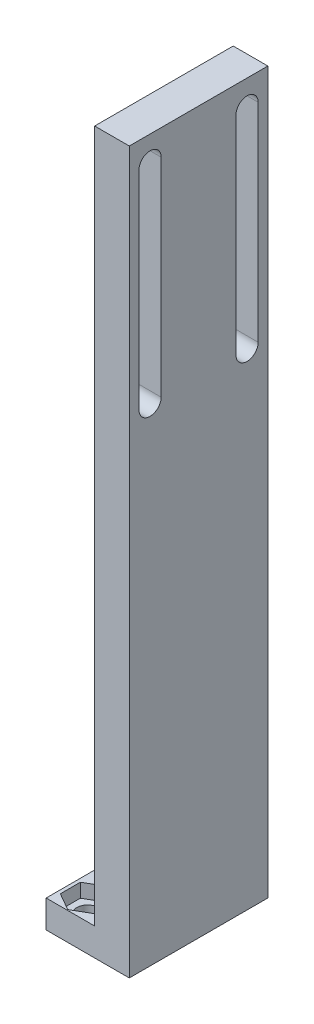
ISO-10303-21;
HEADER;
FILE_DESCRIPTION(('STEP AP214'),'2;1');
FILE_NAME('part.step','',(''),(''),'','','');
FILE_SCHEMA(('AUTOMOTIVE_DESIGN { 1 0 10303 214 1 1 1 1 }'));
ENDSEC;
DATA;
#1=APPLICATION_CONTEXT('core data for automotive mechanical design processes');
#2=APPLICATION_PROTOCOL_DEFINITION('international standard','automotive_design',2000,#1);
#3=PRODUCT_CONTEXT('',#1,'mechanical');
#4=PRODUCT('Part','Part','',(#3));
#5=PRODUCT_RELATED_PRODUCT_CATEGORY('part','',(#4));
#6=PRODUCT_DEFINITION_FORMATION('','',#4);
#7=PRODUCT_DEFINITION_CONTEXT('part definition',#1,'design');
#8=PRODUCT_DEFINITION('design','',#6,#7);
#9=PRODUCT_DEFINITION_SHAPE('','',#8);
#10=(LENGTH_UNIT() NAMED_UNIT(*) SI_UNIT(.MILLI.,.METRE.));
#11=(NAMED_UNIT(*) PLANE_ANGLE_UNIT() SI_UNIT($,.RADIAN.));
#12=(NAMED_UNIT(*) SI_UNIT($,.STERADIAN.) SOLID_ANGLE_UNIT());
#13=UNCERTAINTY_MEASURE_WITH_UNIT(LENGTH_MEASURE(1.E-05),#10,'distance_accuracy_value','');
#14=(GEOMETRIC_REPRESENTATION_CONTEXT(3) GLOBAL_UNCERTAINTY_ASSIGNED_CONTEXT((#13)) GLOBAL_UNIT_ASSIGNED_CONTEXT((#10,
#11,#12)) REPRESENTATION_CONTEXT('',''));
#15=CARTESIAN_POINT('',(0.,0.,0.));
#16=DIRECTION('',(0.,0.,1.));
#17=DIRECTION('',(1.,0.,0.));
#18=AXIS2_PLACEMENT_3D('',#15,#16,#17);
#19=CARTESIAN_POINT('',(-3.,4.,-7.));
#20=DIRECTION('',(0.,-1.,0.));
#21=DIRECTION('',(0.,0.,-1.));
#22=AXIS2_PLACEMENT_3D('',#19,#20,#21);
#23=CYLINDRICAL_SURFACE('',#22,1.6);
#24=CARTESIAN_POINT('',(-3.,0.,-7.));
#25=DIRECTION('',(0.,1.,0.));
#26=DIRECTION('',(0.,0.,1.));
#27=AXIS2_PLACEMENT_3D('',#24,#25,#26);
#28=CIRCLE('',#27,1.6);
#29=CARTESIAN_POINT('',(-3.,0.,-5.4));
#30=VERTEX_POINT('',#29);
#31=EDGE_CURVE('E397',#30,#30,#28,.T.);
#32=ORIENTED_EDGE('',*,*,#31,.F.);
#33=EDGE_LOOP('',(#32));
#34=FACE_BOUND('',#33,.T.);
#35=CARTESIAN_POINT('',(-3.,2.,-7.));
#36=DIRECTION('',(0.,1.,0.));
#37=DIRECTION('',(0.,0.,1.));
#38=AXIS2_PLACEMENT_3D('',#35,#36,#37);
#39=CIRCLE('',#38,1.6);
#40=CARTESIAN_POINT('',(-3.,2.,-5.4));
#41=VERTEX_POINT('',#40);
#42=EDGE_CURVE('E37',#41,#41,#39,.T.);
#43=ORIENTED_EDGE('',*,*,#42,.T.);
#44=EDGE_LOOP('',(#43));
#45=FACE_BOUND('',#44,.T.);
#46=ADVANCED_FACE('F33',(#34,#45),#23,.F.);
#47=CARTESIAN_POINT('',(-3.,4.,7.));
#48=DIRECTION('',(0.,-1.,0.));
#49=DIRECTION('',(0.,0.,-1.));
#50=AXIS2_PLACEMENT_3D('',#47,#48,#49);
#51=CYLINDRICAL_SURFACE('',#50,1.6);
#52=CARTESIAN_POINT('',(-3.,0.,7.));
#53=DIRECTION('',(0.,1.,0.));
#54=DIRECTION('',(0.,0.,1.));
#55=AXIS2_PLACEMENT_3D('',#52,#53,#54);
#56=CIRCLE('',#55,1.6);
#57=CARTESIAN_POINT('',(-3.,0.,8.6));
#58=VERTEX_POINT('',#57);
#59=EDGE_CURVE('E394',#58,#58,#56,.T.);
#60=ORIENTED_EDGE('',*,*,#59,.F.);
#61=EDGE_LOOP('',(#60));
#62=FACE_BOUND('',#61,.T.);
#63=CARTESIAN_POINT('',(-3.,2.,7.));
#64=DIRECTION('',(0.,1.,0.));
#65=DIRECTION('',(0.,0.,1.));
#66=AXIS2_PLACEMENT_3D('',#63,#64,#65);
#67=CIRCLE('',#66,1.6);
#68=CARTESIAN_POINT('',(-3.,2.,8.6));
#69=VERTEX_POINT('',#68);
#70=EDGE_CURVE('E317',#69,#69,#67,.T.);
#71=ORIENTED_EDGE('',*,*,#70,.T.);
#72=EDGE_LOOP('',(#71));
#73=FACE_BOUND('',#72,.T.);
#74=ADVANCED_FACE('F463',(#62,#73),#51,.F.);
#75=CARTESIAN_POINT('',(0.,4.,0.));
#76=DIRECTION('',(0.,1.,0.));
#77=DIRECTION('',(0.,0.,1.));
#78=AXIS2_PLACEMENT_3D('',#75,#76,#77);
#79=PLANE('',#78);
#80=DIRECTION('',(0.870400011805041,0.,-0.492345223851907));
#81=VECTOR('',#80,1.);
#82=CARTESIAN_POINT('',(-3.02563994997294,4.,-4.09194660254121));
#83=LINE('',#82,#81);
#84=CARTESIAN_POINT('',(-3.02563994997294,4.,-4.09194660254121));
#85=VERTEX_POINT('',#84);
#86=CARTESIAN_POINT('',(-0.494371857225514,4.,-5.52376845324228));
#87=VERTEX_POINT('',#86);
#88=EDGE_CURVE('E298',#85,#87,#83,.T.);
#89=ORIENTED_EDGE('',*,*,#88,.F.);
#90=DIRECTION('',(0.861583477190208,0.,0.507615909751487));
#91=VECTOR('',#90,1.);
#92=CARTESIAN_POINT('',(-5.53126809274743,4.,-5.56817814929894));
#93=LINE('',#92,#91);
#94=CARTESIAN_POINT('',(-5.53126809274743,4.,-5.56817814929894));
#95=VERTEX_POINT('',#94);
#96=EDGE_CURVE('E282',#95,#85,#93,.T.);
#97=ORIENTED_EDGE('',*,*,#96,.F.);
#98=DIRECTION('',(-0.00881653461483258,0.,0.999961133603394));
#99=VECTOR('',#98,1.);
#100=CARTESIAN_POINT('',(-5.50562814277449,4.,-8.47623154675772));
#101=LINE('',#100,#99);
#102=CARTESIAN_POINT('',(-5.50562814277449,4.,-8.47623154675772));
#103=VERTEX_POINT('',#102);
#104=EDGE_CURVE('E310',#103,#95,#101,.T.);
#105=ORIENTED_EDGE('',*,*,#104,.F.);
#106=DIRECTION('',(-0.870400011805041,0.,0.492345223851907));
#107=VECTOR('',#106,1.);
#108=CARTESIAN_POINT('',(-2.97436005002706,4.,-9.90805339745879));
#109=LINE('',#108,#107);
#110=CARTESIAN_POINT('',(-2.97436005002706,4.,-9.90805339745879));
#111=VERTEX_POINT('',#110);
#112=EDGE_CURVE('E307',#111,#103,#109,.T.);
#113=ORIENTED_EDGE('',*,*,#112,.F.);
#114=DIRECTION('',(-0.861583477190208,0.,-0.507615909751488));
#115=VECTOR('',#114,1.);
#116=CARTESIAN_POINT('',(-0.468731907252576,4.,-8.43182185070106));
#117=LINE('',#116,#115);
#118=CARTESIAN_POINT('',(-0.468731907252576,4.,-8.43182185070106));
#119=VERTEX_POINT('',#118);
#120=EDGE_CURVE('E304',#119,#111,#117,.T.);
#121=ORIENTED_EDGE('',*,*,#120,.F.);
#122=DIRECTION('',(0.00881653461483156,0.,-0.999961133603394));
#123=VECTOR('',#122,1.);
#124=CARTESIAN_POINT('',(-0.494371857225514,4.,-5.52376845324228));
#125=LINE('',#124,#123);
#126=EDGE_CURVE('E300',#87,#119,#125,.T.);
#127=ORIENTED_EDGE('',*,*,#126,.F.);
#128=EDGE_LOOP('',(#89,#97,#105,#113,#121,#127));
#129=FACE_BOUND('',#128,.T.);
#130=DIRECTION('',(0.865251743184693,0.,-0.5013376316574));
#131=VECTOR('',#130,1.);
#132=CARTESIAN_POINT('',(-2.9955331754008,4.,9.89067124305514));
#133=LINE('',#132,#131);
#134=CARTESIAN_POINT('',(-2.9955331754008,4.,9.89067124305514));
#135=VERTEX_POINT('',#134);
#136=CARTESIAN_POINT('',(-0.494371857225505,4.,8.44146723795042));
#137=VERTEX_POINT('',#136);
#138=EDGE_CURVE('E245',#135,#137,#133,.T.);
#139=ORIENTED_EDGE('',*,*,#138,.F.);
#140=DIRECTION('',(0.86679699648078,0.,0.498661174438013));
#141=VECTOR('',#140,1.);
#142=CARTESIAN_POINT('',(-5.5011613181753,4.,8.44920400510473));
#143=LINE('',#142,#141);
#144=CARTESIAN_POINT('',(-5.5011613181753,4.,8.44920400510473));
#145=VERTEX_POINT('',#144);
#146=EDGE_CURVE('E332',#145,#135,#143,.T.);
#147=ORIENTED_EDGE('',*,*,#146,.F.);
#148=DIRECTION('',(0.00154525329608749,0.,0.999998806095413));
#149=VECTOR('',#148,1.);
#150=CARTESIAN_POINT('',(-5.50562814277449,4.,5.55853276204958));
#151=LINE('',#150,#149);
#152=CARTESIAN_POINT('',(-5.50562814277449,4.,5.55853276204958));
#153=VERTEX_POINT('',#152);
#154=EDGE_CURVE('E358',#153,#145,#151,.T.);
#155=ORIENTED_EDGE('',*,*,#154,.F.);
#156=DIRECTION('',(-0.865251743184693,0.,0.5013376316574));
#157=VECTOR('',#156,1.);
#158=CARTESIAN_POINT('',(-3.0044668245992,4.,4.10932875694486));
#159=LINE('',#158,#157);
#160=CARTESIAN_POINT('',(-3.0044668245992,4.,4.10932875694486));
#161=VERTEX_POINT('',#160);
#162=EDGE_CURVE('E355',#161,#153,#159,.T.);
#163=ORIENTED_EDGE('',*,*,#162,.F.);
#164=DIRECTION('',(-0.86679699648078,0.,-0.498661174438013));
#165=VECTOR('',#164,1.);
#166=CARTESIAN_POINT('',(-0.498838681824703,4.,5.55079599489527));
#167=LINE('',#166,#165);
#168=CARTESIAN_POINT('',(-0.498838681824703,4.,5.55079599489527));
#169=VERTEX_POINT('',#168);
#170=EDGE_CURVE('E352',#169,#161,#167,.T.);
#171=ORIENTED_EDGE('',*,*,#170,.F.);
#172=DIRECTION('',(-0.001545253296087,0.,-0.999998806095413));
#173=VECTOR('',#172,1.);
#174=CARTESIAN_POINT('',(-0.494371857225505,4.,8.44146723795042));
#175=LINE('',#174,#173);
#176=EDGE_CURVE('E349',#137,#169,#175,.T.);
#177=ORIENTED_EDGE('',*,*,#176,.F.);
#178=EDGE_LOOP('',(#139,#147,#155,#163,#171,#177));
#179=FACE_BOUND('',#178,.T.);
#180=DIRECTION('',(0.,0.,1.));
#181=VECTOR('',#180,1.);
#182=CARTESIAN_POINT('',(0.999999999999999,4.,-10.));
#183=LINE('',#182,#181);
#184=CARTESIAN_POINT('',(1.,4.,-10.));
#185=VERTEX_POINT('',#184);
#186=CARTESIAN_POINT('',(1.,4.,10.));
#187=VERTEX_POINT('',#186);
#188=EDGE_CURVE('E378',#185,#187,#183,.T.);
#189=ORIENTED_EDGE('',*,*,#188,.F.);
#190=DIRECTION('',(-1.,0.,0.));
#191=VECTOR('',#190,1.);
#192=CARTESIAN_POINT('',(-6.,4.,-10.));
#193=LINE('',#192,#191);
#194=CARTESIAN_POINT('',(-6.,4.,-10.));
#195=VERTEX_POINT('',#194);
#196=EDGE_CURVE('E401',#185,#195,#193,.T.);
#197=ORIENTED_EDGE('',*,*,#196,.T.);
#198=DIRECTION('',(0.,0.,1.));
#199=VECTOR('',#198,1.);
#200=CARTESIAN_POINT('',(-6.,4.,-10.));
#201=LINE('',#200,#199);
#202=CARTESIAN_POINT('',(-6.,4.,10.));
#203=VERTEX_POINT('',#202);
#204=EDGE_CURVE('E403',#195,#203,#201,.T.);
#205=ORIENTED_EDGE('',*,*,#204,.T.);
#206=DIRECTION('',(1.,0.,0.));
#207=VECTOR('',#206,1.);
#208=CARTESIAN_POINT('',(-6.,4.,10.));
#209=LINE('',#208,#207);
#210=EDGE_CURVE('E406',#203,#187,#209,.T.);
#211=ORIENTED_EDGE('',*,*,#210,.T.);
#212=EDGE_LOOP('',(#189,#197,#205,#211));
#213=FACE_BOUND('',#212,.T.);
#214=ADVANCED_FACE('F459',(#129,#179,#213),#79,.T.);
#215=CARTESIAN_POINT('',(0.,0.,0.));
#216=DIRECTION('',(0.,1.,0.));
#217=DIRECTION('',(0.,0.,1.));
#218=AXIS2_PLACEMENT_3D('',#215,#216,#217);
#219=PLANE('',#218);
#220=DIRECTION('',(0.,0.,-1.));
#221=VECTOR('',#220,1.);
#222=CARTESIAN_POINT('',(6.,0.,-10.));
#223=LINE('',#222,#221);
#224=CARTESIAN_POINT('',(6.,0.,10.));
#225=VERTEX_POINT('',#224);
#226=CARTESIAN_POINT('',(6.,0.,-10.));
#227=VERTEX_POINT('',#226);
#228=EDGE_CURVE('E400',#225,#227,#223,.T.);
#229=ORIENTED_EDGE('',*,*,#228,.F.);
#230=DIRECTION('',(1.,0.,0.));
#231=VECTOR('',#230,1.);
#232=CARTESIAN_POINT('',(-6.,0.,10.));
#233=LINE('',#232,#231);
#234=CARTESIAN_POINT('',(-6.,0.,10.));
#235=VERTEX_POINT('',#234);
#236=EDGE_CURVE('E404',#235,#225,#233,.T.);
#237=ORIENTED_EDGE('',*,*,#236,.F.);
#238=DIRECTION('',(0.,0.,1.));
#239=VECTOR('',#238,1.);
#240=CARTESIAN_POINT('',(-6.,0.,-10.));
#241=LINE('',#240,#239);
#242=CARTESIAN_POINT('',(-6.,0.,-10.));
#243=VERTEX_POINT('',#242);
#244=EDGE_CURVE('E413',#243,#235,#241,.T.);
#245=ORIENTED_EDGE('',*,*,#244,.F.);
#246=DIRECTION('',(-1.,0.,0.));
#247=VECTOR('',#246,1.);
#248=CARTESIAN_POINT('',(-6.,0.,-10.));
#249=LINE('',#248,#247);
#250=EDGE_CURVE('E411',#227,#243,#249,.T.);
#251=ORIENTED_EDGE('',*,*,#250,.F.);
#252=EDGE_LOOP('',(#229,#237,#245,#251));
#253=FACE_BOUND('',#252,.T.);
#254=ORIENTED_EDGE('',*,*,#31,.T.);
#255=EDGE_LOOP('',(#254));
#256=FACE_BOUND('',#255,.T.);
#257=ORIENTED_EDGE('',*,*,#59,.T.);
#258=EDGE_LOOP('',(#257));
#259=FACE_BOUND('',#258,.T.);
#260=ADVANCED_FACE('F462',(#253,#256,#259),#219,.F.);
#261=CARTESIAN_POINT('',(6.,4.,-10.));
#262=DIRECTION('',(-1.,0.,0.));
#263=DIRECTION('',(0.,0.,1.));
#264=AXIS2_PLACEMENT_3D('',#261,#262,#263);
#265=PLANE('',#264);
#266=DIRECTION('',(0.,-1.,0.));
#267=VECTOR('',#266,1.);
#268=CARTESIAN_POINT('',(6.,100.304925489103,8.6));
#269=LINE('',#268,#267);
#270=CARTESIAN_POINT('',(6.,100.304925489103,8.6));
#271=VERTEX_POINT('',#270);
#272=CARTESIAN_POINT('',(6.,70.3049254891028,8.59999999999999));
#273=VERTEX_POINT('',#272);
#274=EDGE_CURVE('E238',#271,#273,#269,.T.);
#275=ORIENTED_EDGE('',*,*,#274,.F.);
#276=CARTESIAN_POINT('',(6.,100.304925489103,7.00000000000001));
#277=DIRECTION('',(1.,0.,0.));
#278=DIRECTION('',(0.,0.,-1.));
#279=AXIS2_PLACEMENT_3D('',#276,#277,#278);
#280=CIRCLE('',#279,1.6);
#281=CARTESIAN_POINT('',(6.,100.304925489103,5.40000000000001));
#282=VERTEX_POINT('',#281);
#283=EDGE_CURVE('E50',#282,#271,#280,.T.);
#284=ORIENTED_EDGE('',*,*,#283,.F.);
#285=DIRECTION('',(0.,1.,0.));
#286=VECTOR('',#285,1.);
#287=CARTESIAN_POINT('',(6.,100.304925489103,5.40000000000001));
#288=LINE('',#287,#286);
#289=CARTESIAN_POINT('',(6.,70.3049254891028,5.4));
#290=VERTEX_POINT('',#289);
#291=EDGE_CURVE('E229',#290,#282,#288,.T.);
#292=ORIENTED_EDGE('',*,*,#291,.F.);
#293=CARTESIAN_POINT('',(6.,70.3049254891028,7.));
#294=DIRECTION('',(1.,0.,0.));
#295=DIRECTION('',(0.,0.,-1.));
#296=AXIS2_PLACEMENT_3D('',#293,#294,#295);
#297=CIRCLE('',#296,1.6);
#298=EDGE_CURVE('E232',#273,#290,#297,.T.);
#299=ORIENTED_EDGE('',*,*,#298,.F.);
#300=EDGE_LOOP('',(#275,#284,#292,#299));
#301=FACE_BOUND('',#300,.T.);
#302=DIRECTION('',(0.,-1.,0.));
#303=VECTOR('',#302,1.);
#304=CARTESIAN_POINT('',(6.,100.170306459103,-5.4));
#305=LINE('',#304,#303);
#306=CARTESIAN_POINT('',(6.,100.170306459103,-5.4));
#307=VERTEX_POINT('',#306);
#308=CARTESIAN_POINT('',(6.,70.1703064591032,-5.40000000000001));
#309=VERTEX_POINT('',#308);
#310=EDGE_CURVE('E264',#307,#309,#305,.T.);
#311=ORIENTED_EDGE('',*,*,#310,.F.);
#312=CARTESIAN_POINT('',(6.,100.170306459103,-7.));
#313=DIRECTION('',(1.,0.,0.));
#314=DIRECTION('',(0.,0.,-1.));
#315=AXIS2_PLACEMENT_3D('',#312,#313,#314);
#316=CIRCLE('',#315,1.6);
#317=CARTESIAN_POINT('',(6.,100.170306459103,-8.6));
#318=VERTEX_POINT('',#317);
#319=EDGE_CURVE('E58',#318,#307,#316,.T.);
#320=ORIENTED_EDGE('',*,*,#319,.F.);
#321=DIRECTION('',(0.,1.,0.));
#322=VECTOR('',#321,1.);
#323=CARTESIAN_POINT('',(6.,100.170306459103,-8.6));
#324=LINE('',#323,#322);
#325=CARTESIAN_POINT('',(6.,70.1703064591032,-8.6));
#326=VERTEX_POINT('',#325);
#327=EDGE_CURVE('E253',#326,#318,#324,.T.);
#328=ORIENTED_EDGE('',*,*,#327,.F.);
#329=CARTESIAN_POINT('',(6.,70.1703064591032,-7.00000000000001));
#330=DIRECTION('',(1.,0.,0.));
#331=DIRECTION('',(0.,0.,-1.));
#332=AXIS2_PLACEMENT_3D('',#329,#330,#331);
#333=CIRCLE('',#332,1.6);
#334=EDGE_CURVE('E267',#309,#326,#333,.T.);
#335=ORIENTED_EDGE('',*,*,#334,.F.);
#336=EDGE_LOOP('',(#311,#320,#328,#335));
#337=FACE_BOUND('',#336,.T.);
#338=ORIENTED_EDGE('',*,*,#228,.T.);
#339=DIRECTION('',(0.,-1.,0.));
#340=VECTOR('',#339,1.);
#341=CARTESIAN_POINT('',(6.,4.,-10.));
#342=LINE('',#341,#340);
#343=CARTESIAN_POINT('',(6.,104.,-10.));
#344=VERTEX_POINT('',#343);
#345=EDGE_CURVE('E11',#344,#227,#342,.T.);
#346=ORIENTED_EDGE('',*,*,#345,.F.);
#347=DIRECTION('',(0.,0.,-1.));
#348=VECTOR('',#347,1.);
#349=CARTESIAN_POINT('',(6.,104.,-10.));
#350=LINE('',#349,#348);
#351=CARTESIAN_POINT('',(6.,104.,10.));
#352=VERTEX_POINT('',#351);
#353=EDGE_CURVE('E381',#352,#344,#350,.T.);
#354=ORIENTED_EDGE('',*,*,#353,.F.);
#355=DIRECTION('',(0.,-1.,0.));
#356=VECTOR('',#355,1.);
#357=CARTESIAN_POINT('',(6.,4.,10.));
#358=LINE('',#357,#356);
#359=EDGE_CURVE('E408',#352,#225,#358,.T.);
#360=ORIENTED_EDGE('',*,*,#359,.T.);
#361=EDGE_LOOP('',(#338,#346,#354,#360));
#362=FACE_BOUND('',#361,.T.);
#363=ADVANCED_FACE('F35',(#301,#337,#362),#265,.F.);
#364=CARTESIAN_POINT('',(-6.,4.,-10.));
#365=DIRECTION('',(0.,0.,1.));
#366=DIRECTION('',(1.,0.,0.));
#367=AXIS2_PLACEMENT_3D('',#364,#365,#366);
#368=PLANE('',#367);
#369=ORIENTED_EDGE('',*,*,#250,.T.);
#370=DIRECTION('',(0.,-1.,0.));
#371=VECTOR('',#370,1.);
#372=CARTESIAN_POINT('',(-6.,4.,-10.));
#373=LINE('',#372,#371);
#374=EDGE_CURVE('E42',#195,#243,#373,.T.);
#375=ORIENTED_EDGE('',*,*,#374,.F.);
#376=ORIENTED_EDGE('',*,*,#196,.F.);
#377=DIRECTION('',(0.,-1.,0.));
#378=VECTOR('',#377,1.);
#379=CARTESIAN_POINT('',(0.999999999999999,104.,-10.));
#380=LINE('',#379,#378);
#381=CARTESIAN_POINT('',(0.999999999999999,104.,-10.));
#382=VERTEX_POINT('',#381);
#383=EDGE_CURVE('E386',#382,#185,#380,.T.);
#384=ORIENTED_EDGE('',*,*,#383,.F.);
#385=DIRECTION('',(-1.,0.,0.));
#386=VECTOR('',#385,1.);
#387=CARTESIAN_POINT('',(0.999999999999999,104.,-10.));
#388=LINE('',#387,#386);
#389=EDGE_CURVE('E384',#344,#382,#388,.T.);
#390=ORIENTED_EDGE('',*,*,#389,.F.);
#391=ORIENTED_EDGE('',*,*,#345,.T.);
#392=EDGE_LOOP('',(#369,#375,#376,#384,#390,#391));
#393=FACE_BOUND('',#392,.T.);
#394=ADVANCED_FACE('F476',(#393),#368,.F.);
#395=CARTESIAN_POINT('',(-6.,4.,-10.));
#396=DIRECTION('',(1.,0.,0.));
#397=DIRECTION('',(0.,0.,-1.));
#398=AXIS2_PLACEMENT_3D('',#395,#396,#397);
#399=PLANE('',#398);
#400=ORIENTED_EDGE('',*,*,#244,.T.);
#401=DIRECTION('',(0.,-1.,0.));
#402=VECTOR('',#401,1.);
#403=CARTESIAN_POINT('',(-6.,4.,10.));
#404=LINE('',#403,#402);
#405=EDGE_CURVE('E418',#203,#235,#404,.T.);
#406=ORIENTED_EDGE('',*,*,#405,.F.);
#407=ORIENTED_EDGE('',*,*,#204,.F.);
#408=ORIENTED_EDGE('',*,*,#374,.T.);
#409=EDGE_LOOP('',(#400,#406,#407,#408));
#410=FACE_BOUND('',#409,.T.);
#411=ADVANCED_FACE('F491',(#410),#399,.F.);
#412=CARTESIAN_POINT('',(-6.,4.,10.));
#413=DIRECTION('',(0.,0.,-1.));
#414=DIRECTION('',(-1.,0.,0.));
#415=AXIS2_PLACEMENT_3D('',#412,#413,#414);
#416=PLANE('',#415);
#417=ORIENTED_EDGE('',*,*,#236,.T.);
#418=ORIENTED_EDGE('',*,*,#359,.F.);
#419=DIRECTION('',(1.,0.,0.));
#420=VECTOR('',#419,1.);
#421=CARTESIAN_POINT('',(1.,104.,10.));
#422=LINE('',#421,#420);
#423=CARTESIAN_POINT('',(1.,104.,10.));
#424=VERTEX_POINT('',#423);
#425=EDGE_CURVE('E377',#424,#352,#422,.T.);
#426=ORIENTED_EDGE('',*,*,#425,.F.);
#427=DIRECTION('',(0.,-1.,0.));
#428=VECTOR('',#427,1.);
#429=CARTESIAN_POINT('',(1.,104.,10.));
#430=LINE('',#429,#428);
#431=EDGE_CURVE('E391',#424,#187,#430,.T.);
#432=ORIENTED_EDGE('',*,*,#431,.T.);
#433=ORIENTED_EDGE('',*,*,#210,.F.);
#434=ORIENTED_EDGE('',*,*,#405,.T.);
#435=EDGE_LOOP('',(#417,#418,#426,#432,#433,#434));
#436=FACE_BOUND('',#435,.T.);
#437=ADVANCED_FACE('F493',(#436),#416,.F.);
#438=CARTESIAN_POINT('',(0.999999999999999,104.,-10.));
#439=DIRECTION('',(1.,0.,0.));
#440=DIRECTION('',(0.,0.,-1.));
#441=AXIS2_PLACEMENT_3D('',#438,#439,#440);
#442=PLANE('',#441);
#443=DIRECTION('',(0.,1.,0.));
#444=VECTOR('',#443,1.);
#445=CARTESIAN_POINT('',(1.,100.304925489103,5.40000000000001));
#446=LINE('',#445,#444);
#447=CARTESIAN_POINT('',(1.,70.3049254891028,5.4));
#448=VERTEX_POINT('',#447);
#449=CARTESIAN_POINT('',(1.,100.304925489103,5.40000000000001));
#450=VERTEX_POINT('',#449);
#451=EDGE_CURVE('E216',#448,#450,#446,.T.);
#452=ORIENTED_EDGE('',*,*,#451,.T.);
#453=CARTESIAN_POINT('',(1.,100.304925489103,7.00000000000001));
#454=DIRECTION('',(1.,0.,0.));
#455=DIRECTION('',(0.,0.,-1.));
#456=AXIS2_PLACEMENT_3D('',#453,#454,#455);
#457=CIRCLE('',#456,1.6);
#458=CARTESIAN_POINT('',(1.,100.304925489103,8.6));
#459=VERTEX_POINT('',#458);
#460=EDGE_CURVE('E210',#450,#459,#457,.T.);
#461=ORIENTED_EDGE('',*,*,#460,.T.);
#462=DIRECTION('',(0.,-1.,0.));
#463=VECTOR('',#462,1.);
#464=CARTESIAN_POINT('',(1.,100.304925489103,8.6));
#465=LINE('',#464,#463);
#466=CARTESIAN_POINT('',(1.,70.3049254891028,8.59999999999999));
#467=VERTEX_POINT('',#466);
#468=EDGE_CURVE('E220',#459,#467,#465,.T.);
#469=ORIENTED_EDGE('',*,*,#468,.T.);
#470=CARTESIAN_POINT('',(1.,70.3049254891028,7.));
#471=DIRECTION('',(1.,0.,0.));
#472=DIRECTION('',(0.,0.,-1.));
#473=AXIS2_PLACEMENT_3D('',#470,#471,#472);
#474=CIRCLE('',#473,1.6);
#475=EDGE_CURVE('E224',#467,#448,#474,.T.);
#476=ORIENTED_EDGE('',*,*,#475,.T.);
#477=EDGE_LOOP('',(#452,#461,#469,#476));
#478=FACE_BOUND('',#477,.T.);
#479=DIRECTION('',(0.,1.,0.));
#480=VECTOR('',#479,1.);
#481=CARTESIAN_POINT('',(0.999999999999999,100.170306459103,-8.6));
#482=LINE('',#481,#480);
#483=CARTESIAN_POINT('',(0.999999999999999,70.1703064591032,-8.6));
#484=VERTEX_POINT('',#483);
#485=CARTESIAN_POINT('',(0.999999999999999,100.170306459103,-8.6));
#486=VERTEX_POINT('',#485);
#487=EDGE_CURVE('E259',#484,#486,#482,.T.);
#488=ORIENTED_EDGE('',*,*,#487,.T.);
#489=CARTESIAN_POINT('',(0.999999999999999,100.170306459103,-7.));
#490=DIRECTION('',(1.,0.,0.));
#491=DIRECTION('',(0.,0.,-1.));
#492=AXIS2_PLACEMENT_3D('',#489,#490,#491);
#493=CIRCLE('',#492,1.6);
#494=CARTESIAN_POINT('',(0.999999999999999,100.170306459103,-5.4));
#495=VERTEX_POINT('',#494);
#496=EDGE_CURVE('E249',#486,#495,#493,.T.);
#497=ORIENTED_EDGE('',*,*,#496,.T.);
#498=DIRECTION('',(0.,-1.,0.));
#499=VECTOR('',#498,1.);
#500=CARTESIAN_POINT('',(0.999999999999999,100.170306459103,-5.4));
#501=LINE('',#500,#499);
#502=CARTESIAN_POINT('',(1.,70.1703064591032,-5.40000000000001));
#503=VERTEX_POINT('',#502);
#504=EDGE_CURVE('E252',#495,#503,#501,.T.);
#505=ORIENTED_EDGE('',*,*,#504,.T.);
#506=CARTESIAN_POINT('',(0.999999999999999,70.1703064591032,-7.00000000000001));
#507=DIRECTION('',(1.,0.,0.));
#508=DIRECTION('',(0.,0.,-1.));
#509=AXIS2_PLACEMENT_3D('',#506,#507,#508);
#510=CIRCLE('',#509,1.6);
#511=EDGE_CURVE('E256',#503,#484,#510,.T.);
#512=ORIENTED_EDGE('',*,*,#511,.T.);
#513=EDGE_LOOP('',(#488,#497,#505,#512));
#514=FACE_BOUND('',#513,.T.);
#515=ORIENTED_EDGE('',*,*,#188,.T.);
#516=ORIENTED_EDGE('',*,*,#431,.F.);
#517=DIRECTION('',(0.,0.,1.));
#518=VECTOR('',#517,1.);
#519=CARTESIAN_POINT('',(0.999999999999999,104.,-10.));
#520=LINE('',#519,#518);
#521=EDGE_CURVE('E374',#382,#424,#520,.T.);
#522=ORIENTED_EDGE('',*,*,#521,.F.);
#523=ORIENTED_EDGE('',*,*,#383,.T.);
#524=EDGE_LOOP('',(#515,#516,#522,#523));
#525=FACE_BOUND('',#524,.T.);
#526=ADVANCED_FACE('F226',(#478,#514,#525),#442,.F.);
#527=CARTESIAN_POINT('',(0.,104.,0.));
#528=DIRECTION('',(0.,1.,0.));
#529=DIRECTION('',(0.,0.,1.));
#530=AXIS2_PLACEMENT_3D('',#527,#528,#529);
#531=PLANE('',#530);
#532=ORIENTED_EDGE('',*,*,#521,.T.);
#533=ORIENTED_EDGE('',*,*,#425,.T.);
#534=ORIENTED_EDGE('',*,*,#353,.T.);
#535=ORIENTED_EDGE('',*,*,#389,.T.);
#536=EDGE_LOOP('',(#532,#533,#534,#535));
#537=FACE_BOUND('',#536,.T.);
#538=ADVANCED_FACE('F481',(#537),#531,.T.);
#539=CARTESIAN_POINT('',(-2.9955331754008,2.,9.89067124305514));
#540=DIRECTION('',(0.5013376316574,0.,0.865251743184693));
#541=DIRECTION('',(0.865251743184693,0.,-0.5013376316574));
#542=AXIS2_PLACEMENT_3D('',#539,#540,#541);
#543=PLANE('',#542);
#544=ORIENTED_EDGE('',*,*,#138,.T.);
#545=DIRECTION('',(0.,1.,0.));
#546=VECTOR('',#545,1.);
#547=CARTESIAN_POINT('',(-0.494371857225505,2.,8.44146723795042));
#548=LINE('',#547,#546);
#549=CARTESIAN_POINT('',(-0.494371857225505,2.,8.44146723795042));
#550=VERTEX_POINT('',#549);
#551=EDGE_CURVE('E347',#550,#137,#548,.T.);
#552=ORIENTED_EDGE('',*,*,#551,.F.);
#553=DIRECTION('',(0.865251743184693,0.,-0.5013376316574));
#554=VECTOR('',#553,1.);
#555=CARTESIAN_POINT('',(-2.9955331754008,2.,9.89067124305514));
#556=LINE('',#555,#554);
#557=CARTESIAN_POINT('',(-2.9955331754008,2.,9.89067124305514));
#558=VERTEX_POINT('',#557);
#559=EDGE_CURVE('E328',#558,#550,#556,.T.);
#560=ORIENTED_EDGE('',*,*,#559,.F.);
#561=DIRECTION('',(0.,1.,0.));
#562=VECTOR('',#561,1.);
#563=CARTESIAN_POINT('',(-2.9955331754008,2.,9.89067124305514));
#564=LINE('',#563,#562);
#565=EDGE_CURVE('E301',#558,#135,#564,.T.);
#566=ORIENTED_EDGE('',*,*,#565,.T.);
#567=EDGE_LOOP('',(#544,#552,#560,#566));
#568=FACE_BOUND('',#567,.T.);
#569=ADVANCED_FACE('F568',(#568),#543,.F.);
#570=CARTESIAN_POINT('',(-5.5011613181753,2.,8.44920400510473));
#571=DIRECTION('',(-0.498661174438013,0.,0.86679699648078));
#572=DIRECTION('',(0.86679699648078,0.,0.498661174438013));
#573=AXIS2_PLACEMENT_3D('',#570,#571,#572);
#574=PLANE('',#573);
#575=ORIENTED_EDGE('',*,*,#146,.T.);
#576=ORIENTED_EDGE('',*,*,#565,.F.);
#577=DIRECTION('',(0.86679699648078,0.,0.498661174438013));
#578=VECTOR('',#577,1.);
#579=CARTESIAN_POINT('',(-5.5011613181753,2.,8.44920400510473));
#580=LINE('',#579,#578);
#581=CARTESIAN_POINT('',(-5.5011613181753,2.,8.44920400510473));
#582=VERTEX_POINT('',#581);
#583=EDGE_CURVE('E344',#582,#558,#580,.T.);
#584=ORIENTED_EDGE('',*,*,#583,.F.);
#585=DIRECTION('',(0.,1.,0.));
#586=VECTOR('',#585,1.);
#587=CARTESIAN_POINT('',(-5.5011613181753,2.,8.44920400510473));
#588=LINE('',#587,#586);
#589=EDGE_CURVE('E364',#582,#145,#588,.T.);
#590=ORIENTED_EDGE('',*,*,#589,.T.);
#591=EDGE_LOOP('',(#575,#576,#584,#590));
#592=FACE_BOUND('',#591,.T.);
#593=ADVANCED_FACE('F564',(#592),#574,.F.);
#594=CARTESIAN_POINT('',(-5.50562814277449,2.,5.55853276204958));
#595=DIRECTION('',(-0.999998806095413,0.,0.00154525329608749));
#596=DIRECTION('',(0.00154525329608749,0.,0.999998806095413));
#597=AXIS2_PLACEMENT_3D('',#594,#595,#596);
#598=PLANE('',#597);
#599=ORIENTED_EDGE('',*,*,#154,.T.);
#600=ORIENTED_EDGE('',*,*,#589,.F.);
#601=DIRECTION('',(0.00154525329608749,0.,0.999998806095413));
#602=VECTOR('',#601,1.);
#603=CARTESIAN_POINT('',(-5.50562814277449,2.,5.55853276204958));
#604=LINE('',#603,#602);
#605=CARTESIAN_POINT('',(-5.50562814277449,2.,5.55853276204958));
#606=VERTEX_POINT('',#605);
#607=EDGE_CURVE('E341',#606,#582,#604,.T.);
#608=ORIENTED_EDGE('',*,*,#607,.F.);
#609=DIRECTION('',(0.,1.,0.));
#610=VECTOR('',#609,1.);
#611=CARTESIAN_POINT('',(-5.50562814277449,2.,5.55853276204958));
#612=LINE('',#611,#610);
#613=EDGE_CURVE('E366',#606,#153,#612,.T.);
#614=ORIENTED_EDGE('',*,*,#613,.T.);
#615=EDGE_LOOP('',(#599,#600,#608,#614));
#616=FACE_BOUND('',#615,.T.);
#617=ADVANCED_FACE('F567',(#616),#598,.F.);
#618=CARTESIAN_POINT('',(-3.0044668245992,2.,4.10932875694486));
#619=DIRECTION('',(-0.5013376316574,0.,-0.865251743184693));
#620=DIRECTION('',(-0.865251743184693,0.,0.5013376316574));
#621=AXIS2_PLACEMENT_3D('',#618,#619,#620);
#622=PLANE('',#621);
#623=ORIENTED_EDGE('',*,*,#162,.T.);
#624=ORIENTED_EDGE('',*,*,#613,.F.);
#625=DIRECTION('',(-0.865251743184693,0.,0.5013376316574));
#626=VECTOR('',#625,1.);
#627=CARTESIAN_POINT('',(-3.0044668245992,2.,4.10932875694486));
#628=LINE('',#627,#626);
#629=CARTESIAN_POINT('',(-3.0044668245992,2.,4.10932875694486));
#630=VERTEX_POINT('',#629);
#631=EDGE_CURVE('E338',#630,#606,#628,.T.);
#632=ORIENTED_EDGE('',*,*,#631,.F.);
#633=DIRECTION('',(0.,1.,0.));
#634=VECTOR('',#633,1.);
#635=CARTESIAN_POINT('',(-3.0044668245992,2.,4.10932875694486));
#636=LINE('',#635,#634);
#637=EDGE_CURVE('E368',#630,#161,#636,.T.);
#638=ORIENTED_EDGE('',*,*,#637,.T.);
#639=EDGE_LOOP('',(#623,#624,#632,#638));
#640=FACE_BOUND('',#639,.T.);
#641=ADVANCED_FACE('F572',(#640),#622,.F.);
#642=CARTESIAN_POINT('',(-0.498838681824703,2.,5.55079599489527));
#643=DIRECTION('',(0.498661174438013,0.,-0.86679699648078));
#644=DIRECTION('',(-0.86679699648078,0.,-0.498661174438013));
#645=AXIS2_PLACEMENT_3D('',#642,#643,#644);
#646=PLANE('',#645);
#647=ORIENTED_EDGE('',*,*,#170,.T.);
#648=ORIENTED_EDGE('',*,*,#637,.F.);
#649=DIRECTION('',(-0.86679699648078,0.,-0.498661174438013));
#650=VECTOR('',#649,1.);
#651=CARTESIAN_POINT('',(-0.498838681824703,2.,5.55079599489527));
#652=LINE('',#651,#650);
#653=CARTESIAN_POINT('',(-0.498838681824703,2.,5.55079599489527));
#654=VERTEX_POINT('',#653);
#655=EDGE_CURVE('E335',#654,#630,#652,.T.);
#656=ORIENTED_EDGE('',*,*,#655,.F.);
#657=DIRECTION('',(0.,1.,0.));
#658=VECTOR('',#657,1.);
#659=CARTESIAN_POINT('',(-0.498838681824703,2.,5.55079599489527));
#660=LINE('',#659,#658);
#661=EDGE_CURVE('E370',#654,#169,#660,.T.);
#662=ORIENTED_EDGE('',*,*,#661,.T.);
#663=EDGE_LOOP('',(#647,#648,#656,#662));
#664=FACE_BOUND('',#663,.T.);
#665=ADVANCED_FACE('F576',(#664),#646,.F.);
#666=CARTESIAN_POINT('',(-0.494371857225505,2.,8.44146723795042));
#667=DIRECTION('',(0.999998806095413,0.,-0.001545253296087));
#668=DIRECTION('',(-0.001545253296087,0.,-0.999998806095413));
#669=AXIS2_PLACEMENT_3D('',#666,#667,#668);
#670=PLANE('',#669);
#671=ORIENTED_EDGE('',*,*,#176,.T.);
#672=ORIENTED_EDGE('',*,*,#661,.F.);
#673=DIRECTION('',(-0.001545253296087,0.,-0.999998806095413));
#674=VECTOR('',#673,1.);
#675=CARTESIAN_POINT('',(-0.494371857225505,2.,8.44146723795042));
#676=LINE('',#675,#674);
#677=EDGE_CURVE('E331',#550,#654,#676,.T.);
#678=ORIENTED_EDGE('',*,*,#677,.F.);
#679=ORIENTED_EDGE('',*,*,#551,.T.);
#680=EDGE_LOOP('',(#671,#672,#678,#679));
#681=FACE_BOUND('',#680,.T.);
#682=ADVANCED_FACE('F562',(#681),#670,.F.);
#683=CARTESIAN_POINT('',(0.,2.,0.));
#684=DIRECTION('',(0.,1.,0.));
#685=DIRECTION('',(0.,0.,1.));
#686=AXIS2_PLACEMENT_3D('',#683,#684,#685);
#687=PLANE('',#686);
#688=ORIENTED_EDGE('',*,*,#70,.F.);
#689=EDGE_LOOP('',(#688));
#690=FACE_BOUND('',#689,.T.);
#691=ORIENTED_EDGE('',*,*,#559,.T.);
#692=ORIENTED_EDGE('',*,*,#677,.T.);
#693=ORIENTED_EDGE('',*,*,#655,.T.);
#694=ORIENTED_EDGE('',*,*,#631,.T.);
#695=ORIENTED_EDGE('',*,*,#607,.T.);
#696=ORIENTED_EDGE('',*,*,#583,.T.);
#697=EDGE_LOOP('',(#691,#692,#693,#694,#695,#696));
#698=FACE_BOUND('',#697,.T.);
#699=ADVANCED_FACE('F559',(#690,#698),#687,.T.);
#700=CARTESIAN_POINT('',(-3.02563994997294,2.,-4.09194660254121));
#701=DIRECTION('',(0.492345223851907,0.,0.870400011805041));
#702=DIRECTION('',(0.870400011805041,0.,-0.492345223851907));
#703=AXIS2_PLACEMENT_3D('',#700,#701,#702);
#704=PLANE('',#703);
#705=ORIENTED_EDGE('',*,*,#88,.T.);
#706=DIRECTION('',(0.,1.,0.));
#707=VECTOR('',#706,1.);
#708=CARTESIAN_POINT('',(-0.494371857225514,2.,-5.52376845324228));
#709=LINE('',#708,#707);
#710=CARTESIAN_POINT('',(-0.494371857225514,2.,-5.52376845324228));
#711=VERTEX_POINT('',#710);
#712=EDGE_CURVE('E297',#711,#87,#709,.T.);
#713=ORIENTED_EDGE('',*,*,#712,.F.);
#714=DIRECTION('',(0.870400011805041,0.,-0.492345223851907));
#715=VECTOR('',#714,1.);
#716=CARTESIAN_POINT('',(-3.02563994997294,2.,-4.09194660254121));
#717=LINE('',#716,#715);
#718=CARTESIAN_POINT('',(-3.02563994997294,2.,-4.09194660254121));
#719=VERTEX_POINT('',#718);
#720=EDGE_CURVE('E278',#719,#711,#717,.T.);
#721=ORIENTED_EDGE('',*,*,#720,.F.);
#722=DIRECTION('',(0.,1.,0.));
#723=VECTOR('',#722,1.);
#724=CARTESIAN_POINT('',(-3.02563994997294,2.,-4.09194660254121));
#725=LINE('',#724,#723);
#726=EDGE_CURVE('E315',#719,#85,#725,.T.);
#727=ORIENTED_EDGE('',*,*,#726,.T.);
#728=EDGE_LOOP('',(#705,#713,#721,#727));
#729=FACE_BOUND('',#728,.T.);
#730=ADVANCED_FACE('F439',(#729),#704,.F.);
#731=CARTESIAN_POINT('',(-5.53126809274743,2.,-5.56817814929894));
#732=DIRECTION('',(-0.507615909751487,0.,0.861583477190208));
#733=DIRECTION('',(0.861583477190208,0.,0.507615909751487));
#734=AXIS2_PLACEMENT_3D('',#731,#732,#733);
#735=PLANE('',#734);
#736=ORIENTED_EDGE('',*,*,#96,.T.);
#737=ORIENTED_EDGE('',*,*,#726,.F.);
#738=DIRECTION('',(0.861583477190208,0.,0.507615909751487));
#739=VECTOR('',#738,1.);
#740=CARTESIAN_POINT('',(-5.53126809274743,2.,-5.56817814929894));
#741=LINE('',#740,#739);
#742=CARTESIAN_POINT('',(-5.53126809274743,2.,-5.56817814929894));
#743=VERTEX_POINT('',#742);
#744=EDGE_CURVE('E294',#743,#719,#741,.T.);
#745=ORIENTED_EDGE('',*,*,#744,.F.);
#746=DIRECTION('',(0.,1.,0.));
#747=VECTOR('',#746,1.);
#748=CARTESIAN_POINT('',(-5.53126809274743,2.,-5.56817814929894));
#749=LINE('',#748,#747);
#750=EDGE_CURVE('E318',#743,#95,#749,.T.);
#751=ORIENTED_EDGE('',*,*,#750,.T.);
#752=EDGE_LOOP('',(#736,#737,#745,#751));
#753=FACE_BOUND('',#752,.T.);
#754=ADVANCED_FACE('F457',(#753),#735,.F.);
#755=CARTESIAN_POINT('',(-5.50562814277449,2.,-8.47623154675772));
#756=DIRECTION('',(-0.999961133603394,0.,-0.00881653461483258));
#757=DIRECTION('',(-0.00881653461483258,0.,0.999961133603394));
#758=AXIS2_PLACEMENT_3D('',#755,#756,#757);
#759=PLANE('',#758);
#760=ORIENTED_EDGE('',*,*,#104,.T.);
#761=ORIENTED_EDGE('',*,*,#750,.F.);
#762=DIRECTION('',(-0.00881653461483258,0.,0.999961133603394));
#763=VECTOR('',#762,1.);
#764=CARTESIAN_POINT('',(-5.50562814277449,2.,-8.47623154675772));
#765=LINE('',#764,#763);
#766=CARTESIAN_POINT('',(-5.50562814277449,2.,-8.47623154675772));
#767=VERTEX_POINT('',#766);
#768=EDGE_CURVE('E291',#767,#743,#765,.T.);
#769=ORIENTED_EDGE('',*,*,#768,.F.);
#770=DIRECTION('',(0.,1.,0.));
#771=VECTOR('',#770,1.);
#772=CARTESIAN_POINT('',(-5.50562814277449,2.,-8.47623154675772));
#773=LINE('',#772,#771);
#774=EDGE_CURVE('E320',#767,#103,#773,.T.);
#775=ORIENTED_EDGE('',*,*,#774,.T.);
#776=EDGE_LOOP('',(#760,#761,#769,#775));
#777=FACE_BOUND('',#776,.T.);
#778=ADVANCED_FACE('F454',(#777),#759,.F.);
#779=CARTESIAN_POINT('',(-2.97436005002706,2.,-9.90805339745879));
#780=DIRECTION('',(-0.492345223851907,0.,-0.870400011805041));
#781=DIRECTION('',(-0.870400011805041,0.,0.492345223851907));
#782=AXIS2_PLACEMENT_3D('',#779,#780,#781);
#783=PLANE('',#782);
#784=ORIENTED_EDGE('',*,*,#112,.T.);
#785=ORIENTED_EDGE('',*,*,#774,.F.);
#786=DIRECTION('',(-0.870400011805041,0.,0.492345223851907));
#787=VECTOR('',#786,1.);
#788=CARTESIAN_POINT('',(-2.97436005002706,2.,-9.90805339745879));
#789=LINE('',#788,#787);
#790=CARTESIAN_POINT('',(-2.97436005002706,2.,-9.90805339745879));
#791=VERTEX_POINT('',#790);
#792=EDGE_CURVE('E288',#791,#767,#789,.T.);
#793=ORIENTED_EDGE('',*,*,#792,.F.);
#794=DIRECTION('',(0.,1.,0.));
#795=VECTOR('',#794,1.);
#796=CARTESIAN_POINT('',(-2.97436005002706,2.,-9.90805339745879));
#797=LINE('',#796,#795);
#798=EDGE_CURVE('E322',#791,#111,#797,.T.);
#799=ORIENTED_EDGE('',*,*,#798,.T.);
#800=EDGE_LOOP('',(#784,#785,#793,#799));
#801=FACE_BOUND('',#800,.T.);
#802=ADVANCED_FACE('F450',(#801),#783,.F.);
#803=CARTESIAN_POINT('',(-0.468731907252576,2.,-8.43182185070106));
#804=DIRECTION('',(0.507615909751488,0.,-0.861583477190208));
#805=DIRECTION('',(-0.861583477190208,0.,-0.507615909751488));
#806=AXIS2_PLACEMENT_3D('',#803,#804,#805);
#807=PLANE('',#806);
#808=ORIENTED_EDGE('',*,*,#120,.T.);
#809=ORIENTED_EDGE('',*,*,#798,.F.);
#810=DIRECTION('',(-0.861583477190208,0.,-0.507615909751488));
#811=VECTOR('',#810,1.);
#812=CARTESIAN_POINT('',(-0.468731907252576,2.,-8.43182185070106));
#813=LINE('',#812,#811);
#814=CARTESIAN_POINT('',(-0.468731907252576,2.,-8.43182185070106));
#815=VERTEX_POINT('',#814);
#816=EDGE_CURVE('E285',#815,#791,#813,.T.);
#817=ORIENTED_EDGE('',*,*,#816,.F.);
#818=DIRECTION('',(0.,1.,0.));
#819=VECTOR('',#818,1.);
#820=CARTESIAN_POINT('',(-0.468731907252576,2.,-8.43182185070106));
#821=LINE('',#820,#819);
#822=EDGE_CURVE('E324',#815,#119,#821,.T.);
#823=ORIENTED_EDGE('',*,*,#822,.T.);
#824=EDGE_LOOP('',(#808,#809,#817,#823));
#825=FACE_BOUND('',#824,.T.);
#826=ADVANCED_FACE('F446',(#825),#807,.F.);
#827=CARTESIAN_POINT('',(-0.494371857225514,2.,-5.52376845324228));
#828=DIRECTION('',(0.999961133603394,0.,0.00881653461483155));
#829=DIRECTION('',(0.00881653461483155,0.,-0.999961133603394));
#830=AXIS2_PLACEMENT_3D('',#827,#828,#829);
#831=PLANE('',#830);
#832=ORIENTED_EDGE('',*,*,#126,.T.);
#833=ORIENTED_EDGE('',*,*,#822,.F.);
#834=DIRECTION('',(0.00881653461483156,0.,-0.999961133603394));
#835=VECTOR('',#834,1.);
#836=CARTESIAN_POINT('',(-0.494371857225514,2.,-5.52376845324228));
#837=LINE('',#836,#835);
#838=EDGE_CURVE('E281',#711,#815,#837,.T.);
#839=ORIENTED_EDGE('',*,*,#838,.F.);
#840=ORIENTED_EDGE('',*,*,#712,.T.);
#841=EDGE_LOOP('',(#832,#833,#839,#840));
#842=FACE_BOUND('',#841,.T.);
#843=ADVANCED_FACE('F433',(#842),#831,.F.);
#844=CARTESIAN_POINT('',(0.,2.,0.));
#845=DIRECTION('',(0.,1.,0.));
#846=DIRECTION('',(0.,0.,1.));
#847=AXIS2_PLACEMENT_3D('',#844,#845,#846);
#848=PLANE('',#847);
#849=ORIENTED_EDGE('',*,*,#42,.F.);
#850=EDGE_LOOP('',(#849));
#851=FACE_BOUND('',#850,.T.);
#852=ORIENTED_EDGE('',*,*,#720,.T.);
#853=ORIENTED_EDGE('',*,*,#838,.T.);
#854=ORIENTED_EDGE('',*,*,#816,.T.);
#855=ORIENTED_EDGE('',*,*,#792,.T.);
#856=ORIENTED_EDGE('',*,*,#768,.T.);
#857=ORIENTED_EDGE('',*,*,#744,.T.);
#858=EDGE_LOOP('',(#852,#853,#854,#855,#856,#857));
#859=FACE_BOUND('',#858,.T.);
#860=ADVANCED_FACE('F429',(#851,#859),#848,.T.);
#861=CARTESIAN_POINT('',(0.999999999999999,100.170306459103,-7.));
#862=DIRECTION('',(1.,0.,0.));
#863=DIRECTION('',(0.,0.,-1.));
#864=AXIS2_PLACEMENT_3D('',#861,#862,#863);
#865=CYLINDRICAL_SURFACE('',#864,1.6);
#866=ORIENTED_EDGE('',*,*,#319,.T.);
#867=DIRECTION('',(1.,0.,0.));
#868=VECTOR('',#867,1.);
#869=CARTESIAN_POINT('',(0.999999999999999,100.170306459103,-5.4));
#870=LINE('',#869,#868);
#871=EDGE_CURVE('E262',#495,#307,#870,.T.);
#872=ORIENTED_EDGE('',*,*,#871,.F.);
#873=ORIENTED_EDGE('',*,*,#496,.F.);
#874=DIRECTION('',(1.,0.,0.));
#875=VECTOR('',#874,1.);
#876=CARTESIAN_POINT('',(0.999999999999999,100.170306459103,-8.6));
#877=LINE('',#876,#875);
#878=EDGE_CURVE('E239',#486,#318,#877,.T.);
#879=ORIENTED_EDGE('',*,*,#878,.T.);
#880=EDGE_LOOP('',(#866,#872,#873,#879));
#881=FACE_BOUND('',#880,.T.);
#882=ADVANCED_FACE('F432',(#881),#865,.F.);
#883=CARTESIAN_POINT('',(0.999999999999999,100.170306459103,-8.6));
#884=DIRECTION('',(0.,0.,-1.));
#885=DIRECTION('',(-1.,0.,0.));
#886=AXIS2_PLACEMENT_3D('',#883,#884,#885);
#887=PLANE('',#886);
#888=ORIENTED_EDGE('',*,*,#327,.T.);
#889=ORIENTED_EDGE('',*,*,#878,.F.);
#890=ORIENTED_EDGE('',*,*,#487,.F.);
#891=DIRECTION('',(1.,0.,0.));
#892=VECTOR('',#891,1.);
#893=CARTESIAN_POINT('',(0.999999999999999,70.1703064591032,-8.6));
#894=LINE('',#893,#892);
#895=EDGE_CURVE('E273',#484,#326,#894,.T.);
#896=ORIENTED_EDGE('',*,*,#895,.T.);
#897=EDGE_LOOP('',(#888,#889,#890,#896));
#898=FACE_BOUND('',#897,.T.);
#899=ADVANCED_FACE('F532',(#898),#887,.F.);
#900=CARTESIAN_POINT('',(0.999999999999999,70.1703064591032,-7.00000000000001));
#901=DIRECTION('',(1.,0.,0.));
#902=DIRECTION('',(0.,0.,-1.));
#903=AXIS2_PLACEMENT_3D('',#900,#901,#902);
#904=CYLINDRICAL_SURFACE('',#903,1.6);
#905=ORIENTED_EDGE('',*,*,#334,.T.);
#906=ORIENTED_EDGE('',*,*,#895,.F.);
#907=ORIENTED_EDGE('',*,*,#511,.F.);
#908=DIRECTION('',(1.,0.,0.));
#909=VECTOR('',#908,1.);
#910=CARTESIAN_POINT('',(0.999999999999999,70.1703064591032,-5.40000000000001));
#911=LINE('',#910,#909);
#912=EDGE_CURVE('E275',#503,#309,#911,.T.);
#913=ORIENTED_EDGE('',*,*,#912,.T.);
#914=EDGE_LOOP('',(#905,#906,#907,#913));
#915=FACE_BOUND('',#914,.T.);
#916=ADVANCED_FACE('F534',(#915),#904,.F.);
#917=CARTESIAN_POINT('',(0.999999999999999,100.170306459103,-5.4));
#918=DIRECTION('',(0.,0.,1.));
#919=DIRECTION('',(0.,-1.,0.));
#920=AXIS2_PLACEMENT_3D('',#917,#918,#919);
#921=PLANE('',#920);
#922=ORIENTED_EDGE('',*,*,#310,.T.);
#923=ORIENTED_EDGE('',*,*,#912,.F.);
#924=ORIENTED_EDGE('',*,*,#504,.F.);
#925=ORIENTED_EDGE('',*,*,#871,.T.);
#926=EDGE_LOOP('',(#922,#923,#924,#925));
#927=FACE_BOUND('',#926,.T.);
#928=ADVANCED_FACE('F527',(#927),#921,.F.);
#929=CARTESIAN_POINT('',(1.,100.304925489103,7.00000000000001));
#930=DIRECTION('',(1.,0.,0.));
#931=DIRECTION('',(0.,0.,-1.));
#932=AXIS2_PLACEMENT_3D('',#929,#930,#931);
#933=CYLINDRICAL_SURFACE('',#932,1.6);
#934=ORIENTED_EDGE('',*,*,#283,.T.);
#935=DIRECTION('',(1.,0.,0.));
#936=VECTOR('',#935,1.);
#937=CARTESIAN_POINT('',(1.,100.304925489103,8.6));
#938=LINE('',#937,#936);
#939=EDGE_CURVE('E206',#459,#271,#938,.T.);
#940=ORIENTED_EDGE('',*,*,#939,.F.);
#941=ORIENTED_EDGE('',*,*,#460,.F.);
#942=DIRECTION('',(1.,0.,0.));
#943=VECTOR('',#942,1.);
#944=CARTESIAN_POINT('',(1.,100.304925489103,5.40000000000001));
#945=LINE('',#944,#943);
#946=EDGE_CURVE('E243',#450,#282,#945,.T.);
#947=ORIENTED_EDGE('',*,*,#946,.T.);
#948=EDGE_LOOP('',(#934,#940,#941,#947));
#949=FACE_BOUND('',#948,.T.);
#950=ADVANCED_FACE('F208',(#949),#933,.F.);
#951=CARTESIAN_POINT('',(1.,100.304925489103,5.40000000000001));
#952=DIRECTION('',(0.,0.,-1.));
#953=DIRECTION('',(0.,1.,0.));
#954=AXIS2_PLACEMENT_3D('',#951,#952,#953);
#955=PLANE('',#954);
#956=ORIENTED_EDGE('',*,*,#291,.T.);
#957=ORIENTED_EDGE('',*,*,#946,.F.);
#958=ORIENTED_EDGE('',*,*,#451,.F.);
#959=DIRECTION('',(1.,0.,0.));
#960=VECTOR('',#959,1.);
#961=CARTESIAN_POINT('',(1.,70.3049254891028,5.4));
#962=LINE('',#961,#960);
#963=EDGE_CURVE('E246',#448,#290,#962,.T.);
#964=ORIENTED_EDGE('',*,*,#963,.T.);
#965=EDGE_LOOP('',(#956,#957,#958,#964));
#966=FACE_BOUND('',#965,.T.);
#967=ADVANCED_FACE('F676',(#966),#955,.F.);
#968=CARTESIAN_POINT('',(1.,70.3049254891028,7.));
#969=DIRECTION('',(1.,0.,0.));
#970=DIRECTION('',(0.,0.,-1.));
#971=AXIS2_PLACEMENT_3D('',#968,#969,#970);
#972=CYLINDRICAL_SURFACE('',#971,1.6);
#973=ORIENTED_EDGE('',*,*,#298,.T.);
#974=ORIENTED_EDGE('',*,*,#963,.F.);
#975=ORIENTED_EDGE('',*,*,#475,.F.);
#976=DIRECTION('',(1.,0.,0.));
#977=VECTOR('',#976,1.);
#978=CARTESIAN_POINT('',(1.,70.3049254891028,8.59999999999999));
#979=LINE('',#978,#977);
#980=EDGE_CURVE('E215',#467,#273,#979,.T.);
#981=ORIENTED_EDGE('',*,*,#980,.T.);
#982=EDGE_LOOP('',(#973,#974,#975,#981));
#983=FACE_BOUND('',#982,.T.);
#984=ADVANCED_FACE('F684',(#983),#972,.F.);
#985=CARTESIAN_POINT('',(1.,100.304925489103,8.6));
#986=DIRECTION('',(0.,0.,1.));
#987=DIRECTION('',(0.,-1.,0.));
#988=AXIS2_PLACEMENT_3D('',#985,#986,#987);
#989=PLANE('',#988);
#990=ORIENTED_EDGE('',*,*,#274,.T.);
#991=ORIENTED_EDGE('',*,*,#980,.F.);
#992=ORIENTED_EDGE('',*,*,#468,.F.);
#993=ORIENTED_EDGE('',*,*,#939,.T.);
#994=EDGE_LOOP('',(#990,#991,#992,#993));
#995=FACE_BOUND('',#994,.T.);
#996=ADVANCED_FACE('F221',(#995),#989,.F.);
#997=CLOSED_SHELL('',(#46,#74,#214,#260,#363,#394,#411,#437,#526,#538,#569,#593,#617,#641,#665,
#682,#699,#730,#754,#778,#802,#826,#843,#860,#882,#899,#916,#928,#950,#967,#984,#996));
#998=MANIFOLD_SOLID_BREP('B2',#997);
#999=ADVANCED_BREP_SHAPE_REPRESENTATION('',(#18,#998),#14);
#1000=SHAPE_DEFINITION_REPRESENTATION(#9,#999);
ENDSEC;
END-ISO-10303-21;
